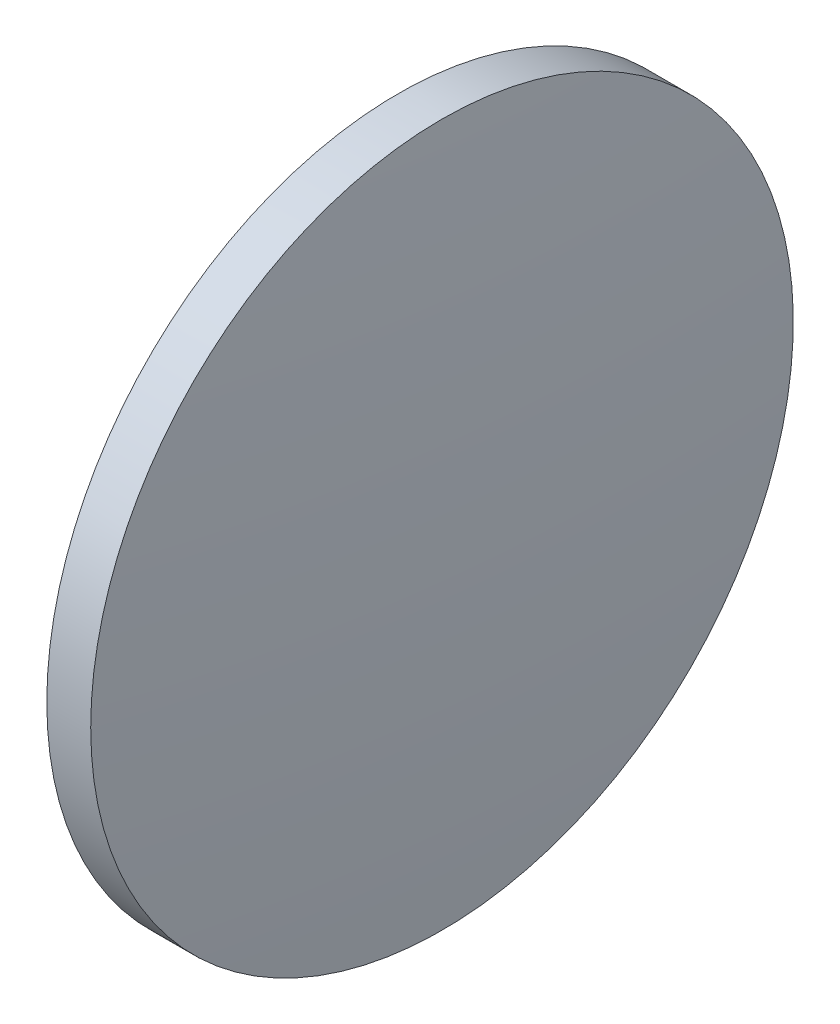
ISO-10303-21;
HEADER;
FILE_DESCRIPTION(('STEP AP214'),'2;1');
FILE_NAME('part.step','',(''),(''),'','','');
FILE_SCHEMA(('AUTOMOTIVE_DESIGN { 1 0 10303 214 1 1 1 1 }'));
ENDSEC;
DATA;
#1=APPLICATION_CONTEXT('core data for automotive mechanical design processes');
#2=APPLICATION_PROTOCOL_DEFINITION('international standard','automotive_design',2000,#1);
#3=PRODUCT_CONTEXT('',#1,'mechanical');
#4=PRODUCT('Part','Part','',(#3));
#5=PRODUCT_RELATED_PRODUCT_CATEGORY('part','',(#4));
#6=PRODUCT_DEFINITION_FORMATION('','',#4);
#7=PRODUCT_DEFINITION_CONTEXT('part definition',#1,'design');
#8=PRODUCT_DEFINITION('design','',#6,#7);
#9=PRODUCT_DEFINITION_SHAPE('','',#8);
#10=(LENGTH_UNIT() NAMED_UNIT(*) SI_UNIT(.MILLI.,.METRE.));
#11=(NAMED_UNIT(*) PLANE_ANGLE_UNIT() SI_UNIT($,.RADIAN.));
#12=(NAMED_UNIT(*) SI_UNIT($,.STERADIAN.) SOLID_ANGLE_UNIT());
#13=UNCERTAINTY_MEASURE_WITH_UNIT(LENGTH_MEASURE(1.E-05),#10,'distance_accuracy_value','');
#14=(GEOMETRIC_REPRESENTATION_CONTEXT(3) GLOBAL_UNCERTAINTY_ASSIGNED_CONTEXT((#13)) GLOBAL_UNIT_ASSIGNED_CONTEXT((#10,
#11,#12)) REPRESENTATION_CONTEXT('',''));
#15=CARTESIAN_POINT('',(0.,0.,0.));
#16=DIRECTION('',(0.,0.,1.));
#17=DIRECTION('',(1.,0.,0.));
#18=AXIS2_PLACEMENT_3D('',#15,#16,#17);
#19=CARTESIAN_POINT('',(1079.41401571448,411.587429833285,0.));
#20=DIRECTION('',(-1.,0.,0.));
#21=DIRECTION('',(0.,1.,0.));
#22=AXIS2_PLACEMENT_3D('',#19,#20,#21);
#23=SPHERICAL_SURFACE('',#22,256.800256410256);
#24=CARTESIAN_POINT('',(1335.43427212474,411.587429833286,0.));
#25=DIRECTION('',(-1.,0.,0.));
#26=DIRECTION('',(0.,0.,1.));
#27=AXIS2_PLACEMENT_3D('',#24,#25,#26);
#28=CIRCLE('',#27,20.);
#29=CARTESIAN_POINT('',(1335.43427212474,411.587429833286,20.));
#30=VERTEX_POINT('',#29);
#31=EDGE_CURVE('E10',#30,#30,#28,.T.);
#32=ORIENTED_EDGE('',*,*,#31,.F.);
#33=EDGE_LOOP('',(#32));
#34=FACE_BOUND('',#33,.T.);
#35=ADVANCED_FACE('F35',(#34),#23,.T.);
#36=CARTESIAN_POINT('',(1328.23972894416,411.587429833286,0.));
#37=DIRECTION('',(-1.,0.,0.));
#38=DIRECTION('',(0.,0.,1.));
#39=AXIS2_PLACEMENT_3D('',#36,#37,#38);
#40=CYLINDRICAL_SURFACE('',#39,20.);
#41=CARTESIAN_POINT('',(1332.93427212474,411.587429833286,0.));
#42=DIRECTION('',(-1.,0.,0.));
#43=DIRECTION('',(0.,0.,1.));
#44=AXIS2_PLACEMENT_3D('',#41,#42,#43);
#45=CIRCLE('',#44,20.);
#46=CARTESIAN_POINT('',(1332.93427212474,411.587429833286,20.));
#47=VERTEX_POINT('',#46);
#48=EDGE_CURVE('E41',#47,#47,#45,.T.);
#49=ORIENTED_EDGE('',*,*,#48,.F.);
#50=EDGE_LOOP('',(#49));
#51=FACE_BOUND('',#50,.T.);
#52=ORIENTED_EDGE('',*,*,#31,.T.);
#53=EDGE_LOOP('',(#52));
#54=FACE_BOUND('',#53,.T.);
#55=ADVANCED_FACE('F49',(#51,#54),#40,.T.);
#56=CARTESIAN_POINT('',(1332.93427212474,411.587429833286,0.));
#57=DIRECTION('',(1.,0.,0.));
#58=DIRECTION('',(0.,0.,-1.));
#59=AXIS2_PLACEMENT_3D('',#56,#57,#58);
#60=PLANE('',#59);
#61=ORIENTED_EDGE('',*,*,#48,.T.);
#62=EDGE_LOOP('',(#61));
#63=FACE_BOUND('',#62,.T.);
#64=ADVANCED_FACE('F47',(#63),#60,.F.);
#65=CLOSED_SHELL('',(#35,#55,#64));
#66=MANIFOLD_SOLID_BREP('B2',#65);
#67=ADVANCED_BREP_SHAPE_REPRESENTATION('',(#18,#66),#14);
#68=SHAPE_DEFINITION_REPRESENTATION(#9,#67);
ENDSEC;
END-ISO-10303-21;
